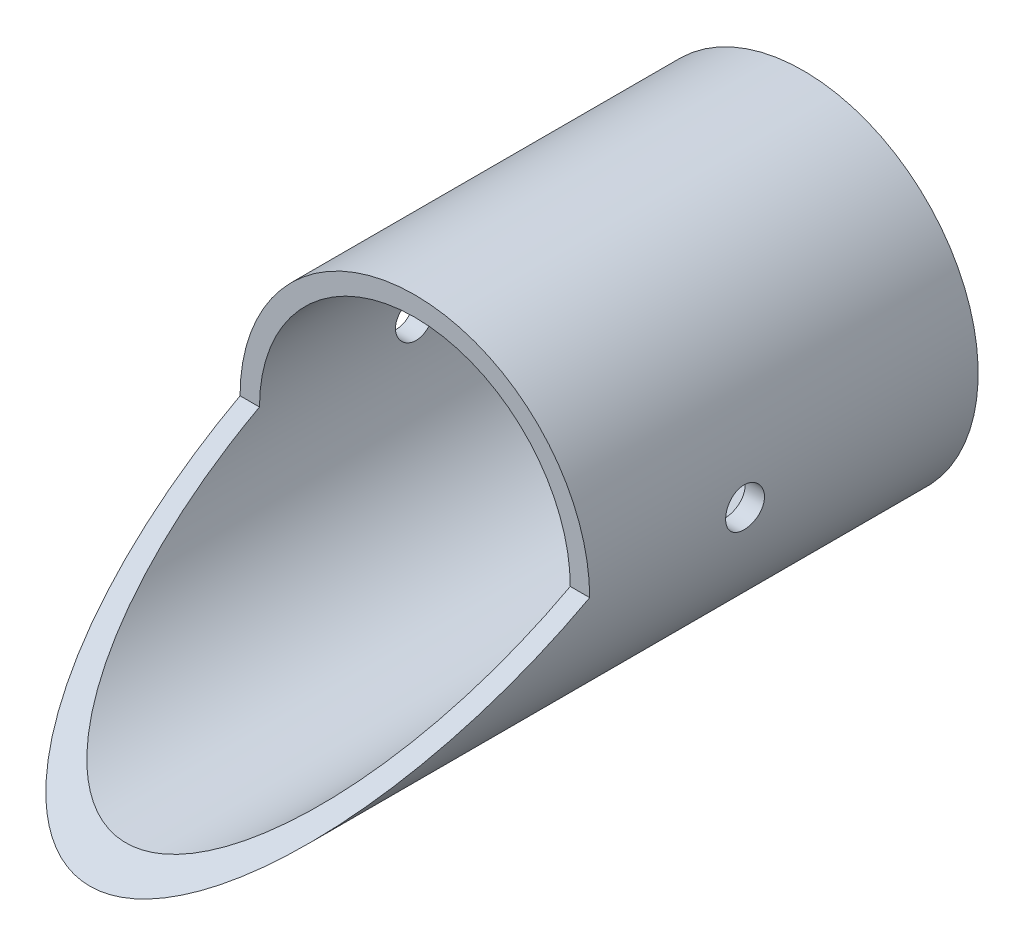
ISO-10303-21;
HEADER;
FILE_DESCRIPTION(('STEP AP214'),'2;1');
FILE_NAME('part.step','',(''),(''),'','','');
FILE_SCHEMA(('AUTOMOTIVE_DESIGN { 1 0 10303 214 1 1 1 1 }'));
ENDSEC;
DATA;
#1=APPLICATION_CONTEXT('core data for automotive mechanical design processes');
#2=APPLICATION_PROTOCOL_DEFINITION('international standard','automotive_design',2000,#1);
#3=PRODUCT_CONTEXT('',#1,'mechanical');
#4=PRODUCT('Part','Part','',(#3));
#5=PRODUCT_RELATED_PRODUCT_CATEGORY('part','',(#4));
#6=PRODUCT_DEFINITION_FORMATION('','',#4);
#7=PRODUCT_DEFINITION_CONTEXT('part definition',#1,'design');
#8=PRODUCT_DEFINITION('design','',#6,#7);
#9=PRODUCT_DEFINITION_SHAPE('','',#8);
#10=(LENGTH_UNIT() NAMED_UNIT(*) SI_UNIT(.MILLI.,.METRE.));
#11=(NAMED_UNIT(*) PLANE_ANGLE_UNIT() SI_UNIT($,.RADIAN.));
#12=(NAMED_UNIT(*) SI_UNIT($,.STERADIAN.) SOLID_ANGLE_UNIT());
#13=UNCERTAINTY_MEASURE_WITH_UNIT(LENGTH_MEASURE(1.E-05),#10,'distance_accuracy_value','');
#14=(GEOMETRIC_REPRESENTATION_CONTEXT(3) GLOBAL_UNCERTAINTY_ASSIGNED_CONTEXT((#13)) GLOBAL_UNIT_ASSIGNED_CONTEXT((#10,
#11,#12)) REPRESENTATION_CONTEXT('',''));
#15=CARTESIAN_POINT('',(0.,0.,0.));
#16=DIRECTION('',(0.,0.,1.));
#17=DIRECTION('',(1.,0.,0.));
#18=AXIS2_PLACEMENT_3D('',#15,#16,#17);
#19=CARTESIAN_POINT('',(0.,0.,-127.));
#20=DIRECTION('',(0.,0.,1.));
#21=DIRECTION('',(1.,0.,0.));
#22=AXIS2_PLACEMENT_3D('',#19,#20,#21);
#23=CYLINDRICAL_SURFACE('',#22,57.15);
#24=CARTESIAN_POINT('',(57.15,0.,-163.405823369828));
#25=CARTESIAN_POINT('',(57.1500005609097,0.177816048876493,-163.405825237907));
#26=CARTESIAN_POINT('',(57.1491684581636,0.355604047240149,-163.398351666346));
#27=CARTESIAN_POINT('',(57.145864492948,0.709967487772472,-163.368513653026));
#28=CARTESIAN_POINT('',(57.1433922462043,0.886542635981262,-163.346145721621));
#29=CARTESIAN_POINT('',(57.13687422781,1.23729697523454,-163.286655331096));
#30=CARTESIAN_POINT('',(57.1328272362062,1.41147420002936,-163.249521432307));
#31=CARTESIAN_POINT('',(57.1232725223232,1.75612236097421,-163.160756614531));
#32=CARTESIAN_POINT('',(57.1177642653076,1.92659191557827,-163.109120388146));
#33=CARTESIAN_POINT('',(57.1054492402291,2.26238128669414,-162.991792531773));
#34=CARTESIAN_POINT('',(57.0986437839985,2.42770611115798,-162.926115093297));
#35=CARTESIAN_POINT('',(57.0839192550528,2.75228402779999,-162.781121418533));
#36=CARTESIAN_POINT('',(57.0759997724479,2.91153485760114,-162.701800159794));
#37=CARTESIAN_POINT('',(57.0592759975992,3.22269899051497,-162.530151211766));
#38=CARTESIAN_POINT('',(57.0504722052186,3.37461636781084,-162.437830858593));
#39=CARTESIAN_POINT('',(57.0322190937194,3.67020768950233,-162.240766908012));
#40=CARTESIAN_POINT('',(57.0227695364524,3.81387855637789,-162.136018716807));
#41=CARTESIAN_POINT('',(57.0034579680289,4.09241269625947,-161.914468952514));
#42=CARTESIAN_POINT('',(56.9935946119046,4.22724289612082,-161.797625915103));
#43=CARTESIAN_POINT('',(56.9737613284258,4.4866414259,-161.55297206519));
#44=CARTESIAN_POINT('',(56.9637913630181,4.61120594337352,-161.425157213659));
#45=CARTESIAN_POINT('',(56.9440331491739,4.84910668497169,-161.159534136842));
#46=CARTESIAN_POINT('',(56.9342448436354,4.96244648771837,-161.021729121009));
#47=CARTESIAN_POINT('',(56.915119986707,5.17718505069055,-160.737000217259));
#48=CARTESIAN_POINT('',(56.9057836033318,5.27857938964015,-160.590072983542));
#49=CARTESIAN_POINT('',(56.8878111460117,5.4688758483936,-160.287828707105));
#50=CARTESIAN_POINT('',(56.8791767139612,5.55774901718543,-160.132493334175));
#51=CARTESIAN_POINT('',(56.8628759896914,5.7221200762037,-159.814781327527));
#52=CARTESIAN_POINT('',(56.8552100575431,5.79761299606994,-159.652402104996));
#53=CARTESIAN_POINT('',(56.8410739120636,5.93460809172924,-159.321855904961));
#54=CARTESIAN_POINT('',(56.8346032293785,5.99611576149038,-159.153691230209));
#55=CARTESIAN_POINT('',(56.8230369054203,6.10474532188343,-158.81271374864));
#56=CARTESIAN_POINT('',(56.8179417699667,6.15186192143035,-158.639899257598));
#57=CARTESIAN_POINT('',(56.8050000380462,6.27065904090687,-158.117897143006));
#58=CARTESIAN_POINT('',(56.7994199806774,6.32050936990799,-157.763402016069));
#59=CARTESIAN_POINT('',(56.7950085271993,6.36001949261459,-157.051229613156));
#60=CARTESIAN_POINT('',(56.796176914606,6.34968121711588,-156.693552439624));
#61=CARTESIAN_POINT('',(56.8050955139542,6.26938780031694,-155.986626396527));
#62=CARTESIAN_POINT('',(56.8128161476685,6.1997005678187,-155.637346892879));
#63=CARTESIAN_POINT('',(56.8339262464922,6.00308367945083,-154.955485186162));
#64=CARTESIAN_POINT('',(56.8473158042613,5.87615308792527,-154.622903256116));
#65=CARTESIAN_POINT('',(56.8782881313644,5.56836564687072,-153.983019960701));
#66=CARTESIAN_POINT('',(56.8958800491986,5.38739092571746,-153.675775746203));
#67=CARTESIAN_POINT('',(56.9332677308336,4.97673546134456,-153.095919751522));
#68=CARTESIAN_POINT('',(56.9530635743076,4.74705295703452,-152.823309224133));
#69=CARTESIAN_POINT('',(56.992760318814,4.24401024782595,-152.318901294524));
#70=CARTESIAN_POINT('',(57.0126612043425,3.97041879128192,-152.087334453295));
#71=CARTESIAN_POINT('',(57.0502242619858,3.38812448509091,-151.673377987962));
#72=CARTESIAN_POINT('',(57.0678864306088,3.07942158068166,-151.49098844056));
#73=CARTESIAN_POINT('',(57.0989898478395,2.43550006602268,-151.180569172048));
#74=CARTESIAN_POINT('',(57.1124300992449,2.10027521475246,-151.052552291064));
#75=CARTESIAN_POINT('',(57.1335657078472,1.41290597464786,-150.854687132738));
#76=CARTESIAN_POINT('',(57.1412612772961,1.06076221143806,-150.784836706276));
#77=CARTESIAN_POINT('',(57.1500130513396,0.35154657859596,-150.705582381854));
#78=CARTESIAN_POINT('',(57.1511041760923,-0.00548934941241151,-150.695860555626));
#79=CARTESIAN_POINT('',(57.1466180282725,-0.716105338897948,-150.736302712455));
#80=CARTESIAN_POINT('',(57.1410408673515,-1.06968545813806,-150.786465692821));
#81=CARTESIAN_POINT('',(57.1238668710918,-1.76242681423452,-150.944989575215));
#82=CARTESIAN_POINT('',(57.1122855538341,-2.10162279450981,-151.053200474033));
#83=CARTESIAN_POINT('',(57.0844013364178,-2.75705020557687,-151.324593672433));
#84=CARTESIAN_POINT('',(57.0680983072234,-3.07328100847677,-151.487777474346));
#85=CARTESIAN_POINT('',(57.0325045826819,-3.67523162451853,-151.865264365942));
#86=CARTESIAN_POINT('',(57.0132018722615,-3.96082056621969,-152.079774994017));
#87=CARTESIAN_POINT('',(56.9738102363796,-4.49205294644288,-152.553531733843));
#88=CARTESIAN_POINT('',(56.9537212864592,-4.73769514104684,-152.812779238155));
#89=CARTESIAN_POINT('',(56.9149149818071,-5.18317562117353,-153.370038718555));
#90=CARTESIAN_POINT('',(56.8962041559337,-5.38280436546451,-153.668218708007));
#91=CARTESIAN_POINT('',(56.8623760009416,-5.72914599578015,-154.294073661438));
#92=CARTESIAN_POINT('',(56.847258612889,-5.87585974965338,-154.621748141572));
#93=CARTESIAN_POINT('',(56.8223696882196,-6.11186737653867,-155.29652303693));
#94=CARTESIAN_POINT('',(56.8125868064234,-6.2012831797148,-155.643580481428));
#95=CARTESIAN_POINT('',(56.7994472548155,-6.32052646211081,-156.348093780007));
#96=CARTESIAN_POINT('',(56.7960903532984,-6.35035608986669,-156.705549258688));
#97=CARTESIAN_POINT('',(56.7961452921592,-6.34981731919166,-157.24034305497));
#98=CARTESIAN_POINT('',(56.7970045174463,-6.34215701251517,-157.417985277052));
#99=CARTESIAN_POINT('',(56.8003667092619,-6.3119826400425,-157.771970182747));
#100=CARTESIAN_POINT('',(56.8028690647539,-6.28947409589637,-157.948313324813));
#101=CARTESIAN_POINT('',(56.809449807706,-6.22975114423565,-158.298514766396));
#102=CARTESIAN_POINT('',(56.8135287709552,-6.19253136395294,-158.472372134005));
#103=CARTESIAN_POINT('',(56.823143225672,-6.10367852096953,-158.816257840445));
#104=CARTESIAN_POINT('',(56.8286781856725,-6.05205071705814,-158.986287551909));
#105=CARTESIAN_POINT('',(56.841048640461,-5.93474215139071,-159.321404555716));
#106=CARTESIAN_POINT('',(56.8478843172011,-5.86905942338476,-159.486491152842));
#107=CARTESIAN_POINT('',(56.8626587900486,-5.72414489037504,-159.810482359911));
#108=CARTESIAN_POINT('',(56.8705971840103,-5.64491802231296,-159.969389196609));
#109=CARTESIAN_POINT('',(56.8873576721608,-5.47343199605317,-160.28003343284));
#110=CARTESIAN_POINT('',(56.8961800831701,-5.38116816067683,-160.431768233125));
#111=CARTESIAN_POINT('',(56.9144544174229,-5.18431690056117,-160.726900957511));
#112=CARTESIAN_POINT('',(56.9239061122923,-5.07973393608525,-160.870301871067));
#113=CARTESIAN_POINT('',(56.9432311438067,-4.85832691293355,-161.148616683459));
#114=CARTESIAN_POINT('',(56.9531065546193,-4.74143725487904,-161.283478257802));
#115=CARTESIAN_POINT('',(56.9729460074962,-4.49677402335917,-161.542837286957));
#116=CARTESIAN_POINT('',(56.9829100159967,-4.36900442639673,-161.667338495756));
#117=CARTESIAN_POINT('',(57.0026552270581,-4.10335747743369,-161.905232288721));
#118=CARTESIAN_POINT('',(57.0124363151128,-3.96547404364705,-162.018618091481));
#119=CARTESIAN_POINT('',(57.0315299842632,-3.68068516957798,-162.233356517142));
#120=CARTESIAN_POINT('',(57.0408427370563,-3.53378308016079,-162.334713568737));
#121=CARTESIAN_POINT('',(57.058771683225,-3.23142123122413,-162.525049796246));
#122=CARTESIAN_POINT('',(57.0673853843867,-3.07593391221797,-162.613985436175));
#123=CARTESIAN_POINT('',(57.0836328110596,-2.75802228820545,-162.778395102966));
#124=CARTESIAN_POINT('',(57.091266895437,-2.59560055273293,-162.853874063427));
#125=CARTESIAN_POINT('',(57.1053359354229,-2.26504776825249,-162.990807148503));
#126=CARTESIAN_POINT('',(57.1117718529729,-2.09692142849408,-163.052272532825));
#127=CARTESIAN_POINT('',(57.1232677572408,-1.75609365667077,-163.160790435943));
#128=CARTESIAN_POINT('',(57.1283280763064,-1.58339334077393,-163.207846436426));
#129=CARTESIAN_POINT('',(57.1383207583435,-1.1781474049039,-163.300058733342));
#130=CARTESIAN_POINT('',(57.1426827086499,-0.944306844017976,-163.339681235092));
#131=CARTESIAN_POINT('',(57.1485219482363,-0.473627597370484,-163.392562238472));
#132=CARTESIAN_POINT('',(57.149999253064,-0.236788927774996,-163.405820882198));
#133=CARTESIAN_POINT('',(57.15,0.,-163.405823369828));
#134=B_SPLINE_CURVE_WITH_KNOTS('',3,(#24,#25,#26,#27,#28,#29,#30,#31,#32,#33,#34,#35,#36,#37,
#38,#39,#40,#41,#42,#43,#44,#45,#46,#47,#48,#49,#50,#51,#52,#53,#54,#55,#56,#57,#58,#59,#60,#61,
#62,#63,#64,#65,#66,#67,#68,#69,#70,#71,#72,#73,#74,#75,#76,#77,#78,#79,#80,#81,#82,#83,#84,#85,
#86,#87,#88,#89,#90,#91,#92,#93,#94,#95,#96,#97,#98,#99,#100,#101,#102,#103,#104,#105,#106,#107,
#108,#109,#110,#111,#112,#113,#114,#115,#116,#117,#118,#119,#120,#121,#122,#123,#124,#125,#126,
#127,#128,#129,#130,#131,#132,#133),.UNSPECIFIED.,.T.,.F.,(4,2,2,2,2,2,2,2,2,2,2,2,2,2,2,2,2,2,
2,2,2,2,2,2,2,2,2,2,2,2,2,2,2,2,2,2,2,2,2,2,2,2,2,2,2,2,2,2,2,2,2,2,2,2,4),(0.,0.53324101923671,
1.06660701717908,1.60038703849729,2.13436266169738,2.66780112354703,3.20143637225644,
3.73477165894474,4.26830470429128,4.80373155168273,5.33935635685182,5.87480984262637,
6.41046089287,6.94733081532389,7.48439975272599,8.02125734194454,8.5583120776753,
9.62681253671113,10.6952787194109,11.7589471193628,12.8226329058507,13.8886557755414,
14.9547171951862,16.0265894346503,17.0984633459042,18.1705902400271,19.2426775196957,
20.3090912880037,21.3754872008932,22.4391405930794,23.5028230557173,24.570881412401,
25.6389730214236,26.7118365434302,27.7846824688085,28.8552377269736,29.9257543827612,
30.4586639644411,30.9913754833747,31.5242817367269,32.0569937382641,32.5897803137029,
33.122373096874,33.6551574419532,34.1877494766639,34.723339858867,35.2587353218002,
35.7944554177155,36.3299776584983,36.8673321284694,37.4044891822509,37.9412131050309,
38.4778072386475,39.1879020278306,39.897992989746),.UNSPECIFIED.);
#135=CARTESIAN_POINT('',(57.15,0.,-163.405823369828));
#136=VERTEX_POINT('',#135);
#137=EDGE_CURVE('E95',#136,#136,#134,.T.);
#138=ORIENTED_EDGE('',*,*,#137,.F.);
#139=EDGE_LOOP('',(#138));
#140=FACE_BOUND('',#139,.T.);
#141=CARTESIAN_POINT('',(-57.15,0.,-163.405823369828));
#142=CARTESIAN_POINT('',(-57.1500005609097,-0.177816048876493,-163.405825237907));
#143=CARTESIAN_POINT('',(-57.1491684581636,-0.355604047240149,-163.398351666346));
#144=CARTESIAN_POINT('',(-57.145864492948,-0.709967487772472,-163.368513653026));
#145=CARTESIAN_POINT('',(-57.1433922462043,-0.886542635981262,-163.346145721621));
#146=CARTESIAN_POINT('',(-57.13687422781,-1.23729697523454,-163.286655331096));
#147=CARTESIAN_POINT('',(-57.1328272362062,-1.41147420002936,-163.249521432307));
#148=CARTESIAN_POINT('',(-57.1232725223232,-1.75612236097421,-163.160756614531));
#149=CARTESIAN_POINT('',(-57.1177642653076,-1.92659191557827,-163.109120388146));
#150=CARTESIAN_POINT('',(-57.1054492402291,-2.26238128669414,-162.991792531773));
#151=CARTESIAN_POINT('',(-57.0986437839985,-2.42770611115798,-162.926115093297));
#152=CARTESIAN_POINT('',(-57.0839192550528,-2.75228402779999,-162.781121418533));
#153=CARTESIAN_POINT('',(-57.0759997724479,-2.91153485760114,-162.701800159794));
#154=CARTESIAN_POINT('',(-57.0592759975992,-3.22269899051497,-162.530151211766));
#155=CARTESIAN_POINT('',(-57.0504722052186,-3.37461636781084,-162.437830858593));
#156=CARTESIAN_POINT('',(-57.0322190937194,-3.67020768950233,-162.240766908012));
#157=CARTESIAN_POINT('',(-57.0227695364524,-3.81387855637789,-162.136018716807));
#158=CARTESIAN_POINT('',(-57.0034579680289,-4.09241269625947,-161.914468952514));
#159=CARTESIAN_POINT('',(-56.9935946119046,-4.22724289612082,-161.797625915103));
#160=CARTESIAN_POINT('',(-56.9737613284258,-4.4866414259,-161.55297206519));
#161=CARTESIAN_POINT('',(-56.9637913630181,-4.61120594337352,-161.425157213659));
#162=CARTESIAN_POINT('',(-56.9440331491739,-4.84910668497169,-161.159534136842));
#163=CARTESIAN_POINT('',(-56.9342448436354,-4.96244648771837,-161.021729121009));
#164=CARTESIAN_POINT('',(-56.915119986707,-5.17718505069055,-160.737000217259));
#165=CARTESIAN_POINT('',(-56.9057836033318,-5.27857938964015,-160.590072983542));
#166=CARTESIAN_POINT('',(-56.8878111460117,-5.4688758483936,-160.287828707105));
#167=CARTESIAN_POINT('',(-56.8791767139612,-5.55774901718543,-160.132493334175));
#168=CARTESIAN_POINT('',(-56.8628759896914,-5.7221200762037,-159.814781327527));
#169=CARTESIAN_POINT('',(-56.8552100575431,-5.79761299606994,-159.652402104996));
#170=CARTESIAN_POINT('',(-56.8410739120636,-5.93460809172924,-159.321855904961));
#171=CARTESIAN_POINT('',(-56.8346032293785,-5.99611576149038,-159.153691230209));
#172=CARTESIAN_POINT('',(-56.8230369054203,-6.10474532188343,-158.81271374864));
#173=CARTESIAN_POINT('',(-56.8179417699667,-6.15186192143035,-158.639899257598));
#174=CARTESIAN_POINT('',(-56.8050000380462,-6.27065904090687,-158.117897143006));
#175=CARTESIAN_POINT('',(-56.7994199806774,-6.32050936990799,-157.763402016069));
#176=CARTESIAN_POINT('',(-56.7950085271993,-6.36001949261459,-157.051229613156));
#177=CARTESIAN_POINT('',(-56.796176914606,-6.34968121711588,-156.693552439624));
#178=CARTESIAN_POINT('',(-56.8050955139542,-6.26938780031694,-155.986626396527));
#179=CARTESIAN_POINT('',(-56.8128161476685,-6.1997005678187,-155.637346892879));
#180=CARTESIAN_POINT('',(-56.8339262464922,-6.00308367945083,-154.955485186162));
#181=CARTESIAN_POINT('',(-56.8473158042613,-5.87615308792527,-154.622903256116));
#182=CARTESIAN_POINT('',(-56.8782881313644,-5.56836564687072,-153.983019960701));
#183=CARTESIAN_POINT('',(-56.8958800491986,-5.38739092571746,-153.675775746203));
#184=CARTESIAN_POINT('',(-56.9332677308336,-4.97673546134456,-153.095919751522));
#185=CARTESIAN_POINT('',(-56.9530635743076,-4.74705295703452,-152.823309224133));
#186=CARTESIAN_POINT('',(-56.992760318814,-4.24401024782595,-152.318901294524));
#187=CARTESIAN_POINT('',(-57.0126612043425,-3.97041879128192,-152.087334453295));
#188=CARTESIAN_POINT('',(-57.0502242619858,-3.38812448509091,-151.673377987962));
#189=CARTESIAN_POINT('',(-57.0678864306088,-3.07942158068166,-151.49098844056));
#190=CARTESIAN_POINT('',(-57.0989898478395,-2.43550006602268,-151.180569172048));
#191=CARTESIAN_POINT('',(-57.1124300992449,-2.10027521475246,-151.052552291064));
#192=CARTESIAN_POINT('',(-57.1335657078472,-1.41290597464786,-150.854687132738));
#193=CARTESIAN_POINT('',(-57.1412612772961,-1.06076221143806,-150.784836706276));
#194=CARTESIAN_POINT('',(-57.1500130513396,-0.35154657859596,-150.705582381854));
#195=CARTESIAN_POINT('',(-57.1511041760923,0.00548934941241151,-150.695860555626));
#196=CARTESIAN_POINT('',(-57.1466180282725,0.716105338897948,-150.736302712455));
#197=CARTESIAN_POINT('',(-57.1410408673515,1.06968545813806,-150.786465692821));
#198=CARTESIAN_POINT('',(-57.1238668710918,1.76242681423452,-150.944989575215));
#199=CARTESIAN_POINT('',(-57.1122855538341,2.10162279450981,-151.053200474033));
#200=CARTESIAN_POINT('',(-57.0844013364178,2.75705020557687,-151.324593672433));
#201=CARTESIAN_POINT('',(-57.0680983072234,3.07328100847677,-151.487777474346));
#202=CARTESIAN_POINT('',(-57.0325045826819,3.67523162451853,-151.865264365942));
#203=CARTESIAN_POINT('',(-57.0132018722615,3.96082056621969,-152.079774994017));
#204=CARTESIAN_POINT('',(-56.9738102363796,4.49205294644288,-152.553531733843));
#205=CARTESIAN_POINT('',(-56.9537212864592,4.73769514104684,-152.812779238155));
#206=CARTESIAN_POINT('',(-56.9149149818071,5.18317562117353,-153.370038718555));
#207=CARTESIAN_POINT('',(-56.8962041559337,5.38280436546451,-153.668218708007));
#208=CARTESIAN_POINT('',(-56.8623760009416,5.72914599578015,-154.294073661438));
#209=CARTESIAN_POINT('',(-56.847258612889,5.87585974965338,-154.621748141572));
#210=CARTESIAN_POINT('',(-56.8223696882196,6.11186737653867,-155.29652303693));
#211=CARTESIAN_POINT('',(-56.8125868064234,6.2012831797148,-155.643580481428));
#212=CARTESIAN_POINT('',(-56.7994472548155,6.32052646211081,-156.348093780007));
#213=CARTESIAN_POINT('',(-56.7960903532984,6.35035608986669,-156.705549258688));
#214=CARTESIAN_POINT('',(-56.7961452921592,6.34981731919166,-157.24034305497));
#215=CARTESIAN_POINT('',(-56.7970045174463,6.34215701251517,-157.417985277052));
#216=CARTESIAN_POINT('',(-56.8003667092619,6.3119826400425,-157.771970182747));
#217=CARTESIAN_POINT('',(-56.8028690647539,6.28947409589637,-157.948313324813));
#218=CARTESIAN_POINT('',(-56.809449807706,6.22975114423565,-158.298514766396));
#219=CARTESIAN_POINT('',(-56.8135287709552,6.19253136395294,-158.472372134005));
#220=CARTESIAN_POINT('',(-56.823143225672,6.10367852096953,-158.816257840445));
#221=CARTESIAN_POINT('',(-56.8286781856725,6.05205071705814,-158.986287551909));
#222=CARTESIAN_POINT('',(-56.841048640461,5.93474215139071,-159.321404555716));
#223=CARTESIAN_POINT('',(-56.8478843172011,5.86905942338476,-159.486491152842));
#224=CARTESIAN_POINT('',(-56.8626587900486,5.72414489037504,-159.810482359911));
#225=CARTESIAN_POINT('',(-56.8705971840103,5.64491802231296,-159.969389196609));
#226=CARTESIAN_POINT('',(-56.8873576721608,5.47343199605317,-160.28003343284));
#227=CARTESIAN_POINT('',(-56.8961800831701,5.38116816067683,-160.431768233125));
#228=CARTESIAN_POINT('',(-56.9144544174229,5.18431690056117,-160.726900957511));
#229=CARTESIAN_POINT('',(-56.9239061122923,5.07973393608525,-160.870301871067));
#230=CARTESIAN_POINT('',(-56.9432311438067,4.85832691293355,-161.148616683459));
#231=CARTESIAN_POINT('',(-56.9531065546193,4.74143725487904,-161.283478257802));
#232=CARTESIAN_POINT('',(-56.9729460074962,4.49677402335917,-161.542837286957));
#233=CARTESIAN_POINT('',(-56.9829100159967,4.36900442639673,-161.667338495756));
#234=CARTESIAN_POINT('',(-57.0026552270581,4.10335747743369,-161.905232288721));
#235=CARTESIAN_POINT('',(-57.0124363151128,3.96547404364705,-162.018618091481));
#236=CARTESIAN_POINT('',(-57.0315299842632,3.68068516957798,-162.233356517142));
#237=CARTESIAN_POINT('',(-57.0408427370563,3.53378308016079,-162.334713568737));
#238=CARTESIAN_POINT('',(-57.058771683225,3.23142123122413,-162.525049796246));
#239=CARTESIAN_POINT('',(-57.0673853843867,3.07593391221797,-162.613985436175));
#240=CARTESIAN_POINT('',(-57.0836328110596,2.75802228820545,-162.778395102966));
#241=CARTESIAN_POINT('',(-57.091266895437,2.59560055273293,-162.853874063427));
#242=CARTESIAN_POINT('',(-57.1053359354229,2.26504776825249,-162.990807148503));
#243=CARTESIAN_POINT('',(-57.1117718529729,2.09692142849408,-163.052272532825));
#244=CARTESIAN_POINT('',(-57.1232677572408,1.75609365667077,-163.160790435943));
#245=CARTESIAN_POINT('',(-57.1283280763064,1.58339334077393,-163.207846436426));
#246=CARTESIAN_POINT('',(-57.1383207583435,1.1781474049039,-163.300058733342));
#247=CARTESIAN_POINT('',(-57.1426827086499,0.944306844017976,-163.339681235092));
#248=CARTESIAN_POINT('',(-57.1485219482363,0.473627597370484,-163.392562238472));
#249=CARTESIAN_POINT('',(-57.149999253064,0.236788927774996,-163.405820882198));
#250=CARTESIAN_POINT('',(-57.15,0.,-163.405823369828));
#251=B_SPLINE_CURVE_WITH_KNOTS('',3,(#141,#142,#143,#144,#145,#146,#147,#148,#149,#150,#151,
#152,#153,#154,#155,#156,#157,#158,#159,#160,#161,#162,#163,#164,#165,#166,#167,#168,#169,#170,
#171,#172,#173,#174,#175,#176,#177,#178,#179,#180,#181,#182,#183,#184,#185,#186,#187,#188,#189,
#190,#191,#192,#193,#194,#195,#196,#197,#198,#199,#200,#201,#202,#203,#204,#205,#206,#207,#208,
#209,#210,#211,#212,#213,#214,#215,#216,#217,#218,#219,#220,#221,#222,#223,#224,#225,#226,#227,
#228,#229,#230,#231,#232,#233,#234,#235,#236,#237,#238,#239,#240,#241,#242,#243,#244,#245,#246,
#247,#248,#249,#250),.UNSPECIFIED.,.T.,.F.,(4,2,2,2,2,2,2,2,2,2,2,2,2,2,2,2,2,2,2,2,2,2,2,2,2,2,
2,2,2,2,2,2,2,2,2,2,2,2,2,2,2,2,2,2,2,2,2,2,2,2,2,2,2,2,4),(0.,0.53324101923671,
1.06660701717908,1.60038703849729,2.13436266169738,2.66780112354703,3.20143637225644,
3.73477165894474,4.26830470429128,4.80373155168273,5.33935635685182,5.87480984262637,
6.41046089287,6.94733081532389,7.48439975272599,8.02125734194454,8.5583120776753,
9.62681253671113,10.6952787194109,11.7589471193628,12.8226329058507,13.8886557755414,
14.9547171951862,16.0265894346503,17.0984633459042,18.1705902400271,19.2426775196957,
20.3090912880037,21.3754872008932,22.4391405930794,23.5028230557173,24.570881412401,
25.6389730214236,26.7118365434302,27.7846824688085,28.8552377269736,29.9257543827612,
30.4586639644411,30.9913754833747,31.5242817367269,32.0569937382641,32.5897803137029,
33.122373096874,33.6551574419532,34.1877494766639,34.723339858867,35.2587353218002,
35.7944554177155,36.3299776584983,36.8673321284694,37.4044891822509,37.9412131050309,
38.4778072386475,39.1879020278306,39.897992989746),.UNSPECIFIED.);
#252=CARTESIAN_POINT('',(-57.15,0.,-163.405823369828));
#253=VERTEX_POINT('',#252);
#254=EDGE_CURVE('E104',#253,#253,#251,.T.);
#255=ORIENTED_EDGE('',*,*,#254,.F.);
#256=EDGE_LOOP('',(#255));
#257=FACE_BOUND('',#256,.T.);
#258=CARTESIAN_POINT('',(0.,0.,-106.255823369828));
#259=DIRECTION('',(0.,-0.880694764772711,-0.473684210526316));
#260=DIRECTION('',(0.,-0.473684210526316,0.880694764772711));
#261=AXIS2_PLACEMENT_3D('',#258,#259,#260);
#262=ELLIPSE('',#261,120.65,57.15);
#263=CARTESIAN_POINT('',(-57.15,0.,-106.255823369828));
#264=VERTEX_POINT('',#263);
#265=CARTESIAN_POINT('',(57.15,0.,-106.255823369828));
#266=VERTEX_POINT('',#265);
#267=EDGE_CURVE('E45',#264,#266,#262,.F.);
#268=ORIENTED_EDGE('',*,*,#267,.F.);
#269=CARTESIAN_POINT('',(0.,0.,-106.255823369828));
#270=DIRECTION('',(0.,0.,-1.));
#271=DIRECTION('',(-1.,0.,0.));
#272=AXIS2_PLACEMENT_3D('',#269,#270,#271);
#273=CIRCLE('',#272,57.15);
#274=EDGE_CURVE('E63',#264,#266,#273,.T.);
#275=ORIENTED_EDGE('',*,*,#274,.T.);
#276=EDGE_LOOP('',(#268,#275));
#277=FACE_BOUND('',#276,.T.);
#278=CARTESIAN_POINT('',(0.,0.,-233.255823369828));
#279=DIRECTION('',(0.,0.,-1.));
#280=DIRECTION('',(-1.,0.,0.));
#281=AXIS2_PLACEMENT_3D('',#278,#279,#280);
#282=CIRCLE('',#281,57.15);
#283=CARTESIAN_POINT('',(-57.15,0.,-233.255823369828));
#284=VERTEX_POINT('',#283);
#285=EDGE_CURVE('E69',#284,#284,#282,.T.);
#286=ORIENTED_EDGE('',*,*,#285,.F.);
#287=EDGE_LOOP('',(#286));
#288=FACE_BOUND('',#287,.T.);
#289=ADVANCED_FACE('F33',(#140,#257,#277,#288),#23,.T.);
#290=CARTESIAN_POINT('',(0.,0.,-127.));
#291=DIRECTION('',(0.,0.,1.));
#292=DIRECTION('',(1.,0.,0.));
#293=AXIS2_PLACEMENT_3D('',#290,#291,#292);
#294=CYLINDRICAL_SURFACE('',#293,50.8);
#295=CARTESIAN_POINT('',(50.8,0.,-163.405823369828));
#296=CARTESIAN_POINT('',(50.8000006834679,0.177660452279512,-163.405825408741));
#297=CARTESIAN_POINT('',(50.7990661797892,0.355290973510378,-163.398364825604));
#298=CARTESIAN_POINT('',(50.7953557357901,0.709338366021,-163.36857979145));
#299=CARTESIAN_POINT('',(50.7925793780872,0.885754953053622,-163.346251971365));
#300=CARTESIAN_POINT('',(50.7852595825664,1.23618570300819,-163.286871034154));
#301=CARTESIAN_POINT('',(50.780714828987,1.4101979769568,-163.249806952175));
#302=CARTESIAN_POINT('',(50.7699847171763,1.75451712697435,-163.161212873706));
#303=CARTESIAN_POINT('',(50.7637987580652,1.92482262115234,-163.109677578595));
#304=CARTESIAN_POINT('',(50.7499683338145,2.26028082300217,-162.992586709574));
#305=CARTESIAN_POINT('',(50.7423254033505,2.42543874168481,-162.927045879442));
#306=CARTESIAN_POINT('',(50.7257879361097,2.74969172401869,-162.782360327768));
#307=CARTESIAN_POINT('',(50.7168929385794,2.90878452822901,-162.703210595841));
#308=CARTESIAN_POINT('',(50.6981073841004,3.21964998300995,-162.531937860928));
#309=CARTESIAN_POINT('',(50.6882173751538,3.37142659557351,-162.439821988));
#310=CARTESIAN_POINT('',(50.667709710111,3.66675816285128,-162.243199085713));
#311=CARTESIAN_POINT('',(50.6570917852451,3.81031004442855,-162.138687468939));
#312=CARTESIAN_POINT('',(50.6353782078992,4.08877364468727,-161.917529523962));
#313=CARTESIAN_POINT('',(50.6242806024837,4.22364310242768,-161.800830173104));
#314=CARTESIAN_POINT('',(50.601961144221,4.48313482314155,-161.556465173291));
#315=CARTESIAN_POINT('',(50.5907392469407,4.60775327790533,-161.428795484586));
#316=CARTESIAN_POINT('',(50.5684951642058,4.84578010749615,-161.163458929903));
#317=CARTESIAN_POINT('',(50.557472916611,4.95919202103945,-161.025795243727));
#318=CARTESIAN_POINT('',(50.5359319534137,5.17409430632028,-160.741340259713));
#319=CARTESIAN_POINT('',(50.5254134250741,5.27558026453382,-160.594545613258));
#320=CARTESIAN_POINT('',(50.505152469446,5.46614935167706,-160.292442086583));
#321=CARTESIAN_POINT('',(50.4954124708714,5.5551942696914,-160.137108932577));
#322=CARTESIAN_POINT('',(50.4770198884538,5.71990676958976,-159.819372840044));
#323=CARTESIAN_POINT('',(50.4683677094924,5.79556937487341,-159.656967299307));
#324=CARTESIAN_POINT('',(50.4524085385076,5.93289692109491,-159.32634018017));
#325=CARTESIAN_POINT('',(50.4451010101934,5.99456744482885,-159.158120952394));
#326=CARTESIAN_POINT('',(50.4320345801864,6.10351153700926,-158.817006729503));
#327=CARTESIAN_POINT('',(50.4262762473126,6.15077981821715,-158.644110042537));
#328=CARTESIAN_POINT('',(50.4116539346605,6.26991974827309,-158.12220461933));
#329=CARTESIAN_POINT('',(50.4053374088251,6.32000152949766,-157.76786663743));
#330=CARTESIAN_POINT('',(50.4003032854169,6.36001442106727,-157.055956680609));
#331=CARTESIAN_POINT('',(50.4015853822611,6.34994795030807,-156.698384836318));
#332=CARTESIAN_POINT('',(50.411557471348,6.27028296446239,-155.992073451851));
#333=CARTESIAN_POINT('',(50.4202051399018,6.20102456737441,-155.643295148532));
#334=CARTESIAN_POINT('',(50.4438714581298,6.00545126391525,-154.9623641722));
#335=CARTESIAN_POINT('',(50.4588902368859,5.8791352015231,-154.630211836192));
#336=CARTESIAN_POINT('',(50.4936536009975,5.5726721749451,-153.990887686426));
#337=CARTESIAN_POINT('',(50.5134111351251,5.39237737135386,-153.683787464354));
#338=CARTESIAN_POINT('',(50.555416054782,4.98317902548834,-153.104074088847));
#339=CARTESIAN_POINT('',(50.5776635541745,4.75427325986253,-152.831462513751));
#340=CARTESIAN_POINT('',(50.6223297954269,4.25246571612426,-152.32648895961));
#341=CARTESIAN_POINT('',(50.6447486577549,3.97927069316312,-152.094418296836));
#342=CARTESIAN_POINT('',(50.6870876657907,3.39764921629989,-151.679382794456));
#343=CARTESIAN_POINT('',(50.7070078057367,3.08922268116003,-151.496418068083));
#344=CARTESIAN_POINT('',(50.7421172666534,2.44566864345095,-151.184787821209));
#345=CARTESIAN_POINT('',(50.7573049978767,2.1105322156625,-151.056140542304));
#346=CARTESIAN_POINT('',(50.7812239587358,1.42318216919016,-150.857028314944));
#347=CARTESIAN_POINT('',(50.7899554906378,1.07096935081085,-150.78656064262));
#348=CARTESIAN_POINT('',(50.7999389488424,0.361983436172466,-150.706185512185));
#349=CARTESIAN_POINT('',(50.8012404379827,0.00525650492410468,-150.695876747823));
#350=CARTESIAN_POINT('',(50.796350985378,-0.704839932523286,-150.73505301573));
#351=CARTESIAN_POINT('',(50.7901602031923,-1.05820951006076,-150.784536774625));
#352=CARTESIAN_POINT('',(50.7710127262508,-1.75037625016445,-150.941560024554));
#353=CARTESIAN_POINT('',(50.7580783360366,-2.08921749090307,-151.048908168057));
#354=CARTESIAN_POINT('',(50.7268917673806,-2.74408812131596,-151.318414118501));
#355=CARTESIAN_POINT('',(50.7086394083772,-3.06011673597601,-151.480573786494));
#356=CARTESIAN_POINT('',(50.6687282995312,-3.66218349013088,-151.856070260998));
#357=CARTESIAN_POINT('',(50.6470524697548,-3.94805857862941,-152.069666653763));
#358=CARTESIAN_POINT('',(50.6027726239969,-4.48004432527765,-152.541607385747));
#359=CARTESIAN_POINT('',(50.580168571199,-4.72615340426592,-152.799953501194));
#360=CARTESIAN_POINT('',(50.5364268452441,-5.17304528191041,-153.355823111533));
#361=CARTESIAN_POINT('',(50.5152982525453,-5.37356206840866,-153.653561265055));
#362=CARTESIAN_POINT('',(50.4770495657174,-5.72173794062838,-154.278739416077));
#363=CARTESIAN_POINT('',(50.4599293912342,-5.86939808596192,-154.606178817993));
#364=CARTESIAN_POINT('',(50.4316957332253,-6.10724499412082,-155.280539400415));
#365=CARTESIAN_POINT('',(50.420566587835,-6.19758172467741,-155.627407141026));
#366=CARTESIAN_POINT('',(50.405537603827,-6.31867625374529,-156.331732633104));
#367=CARTESIAN_POINT('',(50.4016374288984,-6.34943682390104,-156.689189891132));
#368=CARTESIAN_POINT('',(50.4015265602809,-6.35026929057823,-157.223837893229));
#369=CARTESIAN_POINT('',(50.402435095144,-6.34308284910088,-157.401275086278));
#370=CARTESIAN_POINT('',(50.4061013328048,-6.31389085000219,-157.754889160594));
#371=CARTESIAN_POINT('',(50.4088583467614,-6.29189081269728,-157.931066486646));
#372=CARTESIAN_POINT('',(50.4161467962798,-6.23321749451058,-158.280975908565));
#373=CARTESIAN_POINT('',(50.4206788771816,-6.1965388770065,-158.454707091292));
#374=CARTESIAN_POINT('',(50.4313843766276,-6.1087988856385,-158.798382398979));
#375=CARTESIAN_POINT('',(50.4375571981034,-6.05774274337943,-158.968327877229));
#376=CARTESIAN_POINT('',(50.4513689507146,-5.9416147618522,-159.303297163047));
#377=CARTESIAN_POINT('',(50.4590078777996,-5.87654296130371,-159.46832098421));
#378=CARTESIAN_POINT('',(50.4755317786319,-5.73288012300275,-159.792237839942));
#379=CARTESIAN_POINT('',(50.4844162998358,-5.65429399287329,-159.951133074505));
#380=CARTESIAN_POINT('',(50.5031861238308,-5.48411509023544,-160.261812141848));
#381=CARTESIAN_POINT('',(50.5130717928327,-5.39251755330394,-160.413593342466));
#382=CARTESIAN_POINT('',(50.5335596413456,-5.19701859385405,-160.708882463127));
#383=CARTESIAN_POINT('',(50.5441615625256,-5.09312159732418,-160.852393331795));
#384=CARTESIAN_POINT('',(50.5658649879453,-4.87294741221253,-161.131195356753));
#385=CARTESIAN_POINT('',(50.5769694854165,-4.7565881660522,-161.266421486428));
#386=CARTESIAN_POINT('',(50.5992900846758,-4.5129587167504,-161.526555830476));
#387=CARTESIAN_POINT('',(50.6105061445442,-4.38569248450023,-161.651467767676));
#388=CARTESIAN_POINT('',(50.6327447984795,-4.12101889507185,-161.890229953595));
#389=CARTESIAN_POINT('',(50.6437672716371,-3.98360546081123,-162.004073477424));
#390=CARTESIAN_POINT('',(50.6652974325924,-3.6997147044123,-162.219773381039));
#391=CARTESIAN_POINT('',(50.6758053090419,-3.55324074911995,-162.321634173205));
#392=CARTESIAN_POINT('',(50.6960572676804,-3.25157211236692,-162.513096193313));
#393=CARTESIAN_POINT('',(50.7057979692604,-3.09634349922941,-162.602644329539));
#394=CARTESIAN_POINT('',(50.7241863205772,-2.77888304693641,-162.768296927736));
#395=CARTESIAN_POINT('',(50.7328343709848,-2.61665380433059,-162.844406321733));
#396=CARTESIAN_POINT('',(50.7487892612146,-2.28641311158368,-162.982612151045));
#397=CARTESIAN_POINT('',(50.7560971464692,-2.11840629094839,-163.044719517774));
#398=CARTESIAN_POINT('',(50.7691705327862,-1.77774856333513,-163.15452323382));
#399=CARTESIAN_POINT('',(50.7749363976312,-1.60509876229305,-163.202222982424));
#400=CARTESIAN_POINT('',(50.7864482399361,-1.1964522016478,-163.296718286772));
#401=CARTESIAN_POINT('',(50.7915088942137,-0.95904164015275,-163.337590577564));
#402=CARTESIAN_POINT('',(50.7982842992882,-0.481069086110395,-163.392141638744));
#403=CARTESIAN_POINT('',(50.799999074758,-0.240507116815048,-163.405820609657));
#404=CARTESIAN_POINT('',(50.8,0.,-163.405823369828));
#405=B_SPLINE_CURVE_WITH_KNOTS('',3,(#295,#296,#297,#298,#299,#300,#301,#302,#303,#304,#305,
#306,#307,#308,#309,#310,#311,#312,#313,#314,#315,#316,#317,#318,#319,#320,#321,#322,#323,#324,
#325,#326,#327,#328,#329,#330,#331,#332,#333,#334,#335,#336,#337,#338,#339,#340,#341,#342,#343,
#344,#345,#346,#347,#348,#349,#350,#351,#352,#353,#354,#355,#356,#357,#358,#359,#360,#361,#362,
#363,#364,#365,#366,#367,#368,#369,#370,#371,#372,#373,#374,#375,#376,#377,#378,#379,#380,#381,
#382,#383,#384,#385,#386,#387,#388,#389,#390,#391,#392,#393,#394,#395,#396,#397,#398,#399,#400,
#401,#402,#403,#404),.UNSPECIFIED.,.T.,.F.,(4,2,2,2,2,2,2,2,2,2,2,2,2,2,2,2,2,2,2,2,2,2,2,2,2,2,
2,2,2,2,2,2,2,2,2,2,2,2,2,2,2,2,2,2,2,2,2,2,2,2,2,2,2,2,4),(0.,0.532770890036461,
1.06566255254233,1.59895146960222,2.13243590507214,2.66536147825354,3.1984836802343,
3.73131385621671,4.26434184077448,4.79979383345944,5.33544385457954,5.87092418803191,
6.40660207058527,6.9438906528316,7.48137862319397,8.01865175893929,8.55612189720503,
9.6242791662587,10.6923934790566,11.7544113336051,12.8164507062087,13.8814258716387,
14.9464497570325,16.0188371886511,17.0912270930592,18.1639768555689,19.2366763909421,
20.3022119405409,21.3677247983351,22.4297356128784,23.4917824901914,24.5593058783681,
25.6268716489134,26.7005149202785,27.7741366672132,28.8449379307216,29.9156893764559,
30.4479262694048,30.9799649328867,31.512197203143,32.0442360577022,32.5762734424696,
33.1081180284451,33.640157865869,34.1720068262235,34.7076024551421,35.2430039121809,
35.7787286590514,36.3142555153479,36.8520236098181,37.3895939309911,37.9267431051648,
38.4637654468358,39.1850071972271,39.9062436290925),.UNSPECIFIED.);
#406=CARTESIAN_POINT('',(50.8,0.,-163.405823369828));
#407=VERTEX_POINT('',#406);
#408=EDGE_CURVE('E37',#407,#407,#405,.T.);
#409=ORIENTED_EDGE('',*,*,#408,.T.);
#410=EDGE_LOOP('',(#409));
#411=FACE_BOUND('',#410,.T.);
#412=CARTESIAN_POINT('',(-50.8,0.,-163.405823369828));
#413=CARTESIAN_POINT('',(-50.8000006834679,-0.177660452279512,-163.405825408741));
#414=CARTESIAN_POINT('',(-50.7990661797892,-0.355290973510378,-163.398364825604));
#415=CARTESIAN_POINT('',(-50.7953557357901,-0.709338366021,-163.36857979145));
#416=CARTESIAN_POINT('',(-50.7925793780872,-0.885754953053622,-163.346251971365));
#417=CARTESIAN_POINT('',(-50.7852595825664,-1.23618570300819,-163.286871034154));
#418=CARTESIAN_POINT('',(-50.780714828987,-1.4101979769568,-163.249806952175));
#419=CARTESIAN_POINT('',(-50.7699847171763,-1.75451712697435,-163.161212873706));
#420=CARTESIAN_POINT('',(-50.7637987580652,-1.92482262115234,-163.109677578595));
#421=CARTESIAN_POINT('',(-50.7499683338145,-2.26028082300217,-162.992586709574));
#422=CARTESIAN_POINT('',(-50.7423254033505,-2.42543874168481,-162.927045879442));
#423=CARTESIAN_POINT('',(-50.7257879361097,-2.74969172401869,-162.782360327768));
#424=CARTESIAN_POINT('',(-50.7168929385794,-2.90878452822901,-162.703210595841));
#425=CARTESIAN_POINT('',(-50.6981073841004,-3.21964998300995,-162.531937860928));
#426=CARTESIAN_POINT('',(-50.6882173751538,-3.37142659557351,-162.439821988));
#427=CARTESIAN_POINT('',(-50.667709710111,-3.66675816285128,-162.243199085713));
#428=CARTESIAN_POINT('',(-50.6570917852451,-3.81031004442855,-162.138687468939));
#429=CARTESIAN_POINT('',(-50.6353782078992,-4.08877364468727,-161.917529523962));
#430=CARTESIAN_POINT('',(-50.6242806024837,-4.22364310242768,-161.800830173104));
#431=CARTESIAN_POINT('',(-50.601961144221,-4.48313482314155,-161.556465173291));
#432=CARTESIAN_POINT('',(-50.5907392469407,-4.60775327790533,-161.428795484586));
#433=CARTESIAN_POINT('',(-50.5684951642058,-4.84578010749615,-161.163458929903));
#434=CARTESIAN_POINT('',(-50.557472916611,-4.95919202103945,-161.025795243727));
#435=CARTESIAN_POINT('',(-50.5359319534137,-5.17409430632028,-160.741340259713));
#436=CARTESIAN_POINT('',(-50.5254134250741,-5.27558026453382,-160.594545613258));
#437=CARTESIAN_POINT('',(-50.505152469446,-5.46614935167706,-160.292442086583));
#438=CARTESIAN_POINT('',(-50.4954124708714,-5.5551942696914,-160.137108932577));
#439=CARTESIAN_POINT('',(-50.4770198884538,-5.71990676958976,-159.819372840044));
#440=CARTESIAN_POINT('',(-50.4683677094924,-5.79556937487341,-159.656967299307));
#441=CARTESIAN_POINT('',(-50.4524085385076,-5.93289692109491,-159.32634018017));
#442=CARTESIAN_POINT('',(-50.4451010101934,-5.99456744482885,-159.158120952394));
#443=CARTESIAN_POINT('',(-50.4320345801864,-6.10351153700926,-158.817006729503));
#444=CARTESIAN_POINT('',(-50.4262762473126,-6.15077981821715,-158.644110042537));
#445=CARTESIAN_POINT('',(-50.4116539346605,-6.26991974827309,-158.12220461933));
#446=CARTESIAN_POINT('',(-50.4053374088251,-6.32000152949766,-157.76786663743));
#447=CARTESIAN_POINT('',(-50.4003032854169,-6.36001442106727,-157.055956680609));
#448=CARTESIAN_POINT('',(-50.4015853822611,-6.34994795030807,-156.698384836318));
#449=CARTESIAN_POINT('',(-50.411557471348,-6.27028296446239,-155.992073451851));
#450=CARTESIAN_POINT('',(-50.4202051399018,-6.20102456737441,-155.643295148532));
#451=CARTESIAN_POINT('',(-50.4438714581298,-6.00545126391525,-154.9623641722));
#452=CARTESIAN_POINT('',(-50.4588902368859,-5.8791352015231,-154.630211836192));
#453=CARTESIAN_POINT('',(-50.4936536009975,-5.5726721749451,-153.990887686426));
#454=CARTESIAN_POINT('',(-50.5134111351251,-5.39237737135386,-153.683787464354));
#455=CARTESIAN_POINT('',(-50.555416054782,-4.98317902548834,-153.104074088847));
#456=CARTESIAN_POINT('',(-50.5776635541745,-4.75427325986253,-152.831462513751));
#457=CARTESIAN_POINT('',(-50.6223297954269,-4.25246571612426,-152.32648895961));
#458=CARTESIAN_POINT('',(-50.6447486577549,-3.97927069316312,-152.094418296836));
#459=CARTESIAN_POINT('',(-50.6870876657907,-3.39764921629989,-151.679382794456));
#460=CARTESIAN_POINT('',(-50.7070078057367,-3.08922268116003,-151.496418068083));
#461=CARTESIAN_POINT('',(-50.7421172666534,-2.44566864345095,-151.184787821209));
#462=CARTESIAN_POINT('',(-50.7573049978767,-2.1105322156625,-151.056140542304));
#463=CARTESIAN_POINT('',(-50.7812239587358,-1.42318216919016,-150.857028314944));
#464=CARTESIAN_POINT('',(-50.7899554906378,-1.07096935081085,-150.78656064262));
#465=CARTESIAN_POINT('',(-50.7999389488424,-0.361983436172466,-150.706185512185));
#466=CARTESIAN_POINT('',(-50.8012404379827,-0.00525650492410468,-150.695876747823));
#467=CARTESIAN_POINT('',(-50.796350985378,0.704839932523286,-150.73505301573));
#468=CARTESIAN_POINT('',(-50.7901602031923,1.05820951006076,-150.784536774625));
#469=CARTESIAN_POINT('',(-50.7710127262508,1.75037625016445,-150.941560024554));
#470=CARTESIAN_POINT('',(-50.7580783360366,2.08921749090307,-151.048908168057));
#471=CARTESIAN_POINT('',(-50.7268917673806,2.74408812131596,-151.318414118501));
#472=CARTESIAN_POINT('',(-50.7086394083772,3.06011673597601,-151.480573786494));
#473=CARTESIAN_POINT('',(-50.6687282995312,3.66218349013088,-151.856070260998));
#474=CARTESIAN_POINT('',(-50.6470524697548,3.94805857862941,-152.069666653763));
#475=CARTESIAN_POINT('',(-50.6027726239969,4.48004432527765,-152.541607385747));
#476=CARTESIAN_POINT('',(-50.580168571199,4.72615340426592,-152.799953501194));
#477=CARTESIAN_POINT('',(-50.5364268452441,5.17304528191041,-153.355823111533));
#478=CARTESIAN_POINT('',(-50.5152982525453,5.37356206840866,-153.653561265055));
#479=CARTESIAN_POINT('',(-50.4770495657174,5.72173794062838,-154.278739416077));
#480=CARTESIAN_POINT('',(-50.4599293912342,5.86939808596192,-154.606178817993));
#481=CARTESIAN_POINT('',(-50.4316957332253,6.10724499412082,-155.280539400415));
#482=CARTESIAN_POINT('',(-50.420566587835,6.19758172467741,-155.627407141026));
#483=CARTESIAN_POINT('',(-50.405537603827,6.31867625374529,-156.331732633104));
#484=CARTESIAN_POINT('',(-50.4016374288984,6.34943682390104,-156.689189891132));
#485=CARTESIAN_POINT('',(-50.4015265602809,6.35026929057823,-157.223837893229));
#486=CARTESIAN_POINT('',(-50.402435095144,6.34308284910088,-157.401275086278));
#487=CARTESIAN_POINT('',(-50.4061013328048,6.31389085000219,-157.754889160594));
#488=CARTESIAN_POINT('',(-50.4088583467614,6.29189081269728,-157.931066486646));
#489=CARTESIAN_POINT('',(-50.4161467962798,6.23321749451058,-158.280975908565));
#490=CARTESIAN_POINT('',(-50.4206788771816,6.1965388770065,-158.454707091292));
#491=CARTESIAN_POINT('',(-50.4313843766276,6.1087988856385,-158.798382398979));
#492=CARTESIAN_POINT('',(-50.4375571981034,6.05774274337943,-158.968327877229));
#493=CARTESIAN_POINT('',(-50.4513689507146,5.9416147618522,-159.303297163047));
#494=CARTESIAN_POINT('',(-50.4590078777996,5.87654296130371,-159.46832098421));
#495=CARTESIAN_POINT('',(-50.4755317786319,5.73288012300275,-159.792237839942));
#496=CARTESIAN_POINT('',(-50.4844162998358,5.65429399287329,-159.951133074505));
#497=CARTESIAN_POINT('',(-50.5031861238308,5.48411509023544,-160.261812141848));
#498=CARTESIAN_POINT('',(-50.5130717928327,5.39251755330394,-160.413593342466));
#499=CARTESIAN_POINT('',(-50.5335596413456,5.19701859385405,-160.708882463127));
#500=CARTESIAN_POINT('',(-50.5441615625256,5.09312159732418,-160.852393331795));
#501=CARTESIAN_POINT('',(-50.5658649879453,4.87294741221253,-161.131195356753));
#502=CARTESIAN_POINT('',(-50.5769694854165,4.7565881660522,-161.266421486428));
#503=CARTESIAN_POINT('',(-50.5992900846758,4.5129587167504,-161.526555830476));
#504=CARTESIAN_POINT('',(-50.6105061445442,4.38569248450023,-161.651467767676));
#505=CARTESIAN_POINT('',(-50.6327447984795,4.12101889507185,-161.890229953595));
#506=CARTESIAN_POINT('',(-50.6437672716371,3.98360546081123,-162.004073477424));
#507=CARTESIAN_POINT('',(-50.6652974325924,3.6997147044123,-162.219773381039));
#508=CARTESIAN_POINT('',(-50.6758053090419,3.55324074911995,-162.321634173205));
#509=CARTESIAN_POINT('',(-50.6960572676804,3.25157211236692,-162.513096193313));
#510=CARTESIAN_POINT('',(-50.7057979692604,3.09634349922941,-162.602644329539));
#511=CARTESIAN_POINT('',(-50.7241863205772,2.77888304693641,-162.768296927736));
#512=CARTESIAN_POINT('',(-50.7328343709848,2.61665380433059,-162.844406321733));
#513=CARTESIAN_POINT('',(-50.7487892612146,2.28641311158368,-162.982612151045));
#514=CARTESIAN_POINT('',(-50.7560971464692,2.11840629094839,-163.044719517774));
#515=CARTESIAN_POINT('',(-50.7691705327862,1.77774856333513,-163.15452323382));
#516=CARTESIAN_POINT('',(-50.7749363976312,1.60509876229305,-163.202222982424));
#517=CARTESIAN_POINT('',(-50.7864482399361,1.1964522016478,-163.296718286772));
#518=CARTESIAN_POINT('',(-50.7915088942137,0.95904164015275,-163.337590577564));
#519=CARTESIAN_POINT('',(-50.7982842992882,0.481069086110395,-163.392141638744));
#520=CARTESIAN_POINT('',(-50.799999074758,0.240507116815048,-163.405820609657));
#521=CARTESIAN_POINT('',(-50.8,0.,-163.405823369828));
#522=B_SPLINE_CURVE_WITH_KNOTS('',3,(#412,#413,#414,#415,#416,#417,#418,#419,#420,#421,#422,
#423,#424,#425,#426,#427,#428,#429,#430,#431,#432,#433,#434,#435,#436,#437,#438,#439,#440,#441,
#442,#443,#444,#445,#446,#447,#448,#449,#450,#451,#452,#453,#454,#455,#456,#457,#458,#459,#460,
#461,#462,#463,#464,#465,#466,#467,#468,#469,#470,#471,#472,#473,#474,#475,#476,#477,#478,#479,
#480,#481,#482,#483,#484,#485,#486,#487,#488,#489,#490,#491,#492,#493,#494,#495,#496,#497,#498,
#499,#500,#501,#502,#503,#504,#505,#506,#507,#508,#509,#510,#511,#512,#513,#514,#515,#516,#517,
#518,#519,#520,#521),.UNSPECIFIED.,.T.,.F.,(4,2,2,2,2,2,2,2,2,2,2,2,2,2,2,2,2,2,2,2,2,2,2,2,2,2,
2,2,2,2,2,2,2,2,2,2,2,2,2,2,2,2,2,2,2,2,2,2,2,2,2,2,2,2,4),(0.,0.532770890036461,
1.06566255254233,1.59895146960222,2.13243590507214,2.66536147825354,3.1984836802343,
3.73131385621671,4.26434184077448,4.79979383345944,5.33544385457954,5.87092418803191,
6.40660207058527,6.9438906528316,7.48137862319397,8.01865175893929,8.55612189720503,
9.6242791662587,10.6923934790566,11.7544113336051,12.8164507062087,13.8814258716387,
14.9464497570325,16.0188371886511,17.0912270930592,18.1639768555689,19.2366763909421,
20.3022119405409,21.3677247983351,22.4297356128784,23.4917824901914,24.5593058783681,
25.6268716489134,26.7005149202785,27.7741366672132,28.8449379307216,29.9156893764559,
30.4479262694048,30.9799649328867,31.512197203143,32.0442360577022,32.5762734424696,
33.1081180284451,33.640157865869,34.1720068262235,34.7076024551421,35.2430039121809,
35.7787286590514,36.3142555153479,36.8520236098181,37.3895939309911,37.9267431051648,
38.4637654468358,39.1850071972271,39.9062436290925),.UNSPECIFIED.);
#523=CARTESIAN_POINT('',(-50.8,0.,-163.405823369828));
#524=VERTEX_POINT('',#523);
#525=EDGE_CURVE('E84',#524,#524,#522,.T.);
#526=ORIENTED_EDGE('',*,*,#525,.T.);
#527=EDGE_LOOP('',(#526));
#528=FACE_BOUND('',#527,.T.);
#529=CARTESIAN_POINT('',(0.,0.,-106.255823369828));
#530=DIRECTION('',(0.,-0.880694764772711,-0.473684210526316));
#531=DIRECTION('',(0.,-0.473684210526316,0.880694764772711));
#532=AXIS2_PLACEMENT_3D('',#529,#530,#531);
#533=ELLIPSE('',#532,107.244444444444,50.8);
#534=CARTESIAN_POINT('',(-50.7999999999999,0.,-106.255823369828));
#535=VERTEX_POINT('',#534);
#536=CARTESIAN_POINT('',(50.8,0.,-106.255823369828));
#537=VERTEX_POINT('',#536);
#538=EDGE_CURVE('E11',#535,#537,#533,.F.);
#539=ORIENTED_EDGE('',*,*,#538,.T.);
#540=CARTESIAN_POINT('',(0.,0.,-106.255823369828));
#541=DIRECTION('',(0.,0.,-1.));
#542=DIRECTION('',(-1.,0.,0.));
#543=AXIS2_PLACEMENT_3D('',#540,#541,#542);
#544=CIRCLE('',#543,50.7999999999999);
#545=EDGE_CURVE('E53',#535,#537,#544,.T.);
#546=ORIENTED_EDGE('',*,*,#545,.F.);
#547=EDGE_LOOP('',(#539,#546));
#548=FACE_BOUND('',#547,.T.);
#549=CARTESIAN_POINT('',(0.,0.,-233.255823369828));
#550=DIRECTION('',(0.,0.,-1.));
#551=DIRECTION('',(-1.,0.,0.));
#552=AXIS2_PLACEMENT_3D('',#549,#550,#551);
#553=CIRCLE('',#552,50.7999999999999);
#554=CARTESIAN_POINT('',(-50.7999999999999,0.,-233.255823369828));
#555=VERTEX_POINT('',#554);
#556=EDGE_CURVE('E70',#555,#555,#553,.T.);
#557=ORIENTED_EDGE('',*,*,#556,.T.);
#558=EDGE_LOOP('',(#557));
#559=FACE_BOUND('',#558,.T.);
#560=ADVANCED_FACE('F123',(#411,#528,#548,#559),#294,.F.);
#561=CARTESIAN_POINT('',(328.396823142788,0.,-106.255823369828));
#562=DIRECTION('',(0.,-0.880694764772711,-0.473684210526316));
#563=DIRECTION('',(0.,0.473684210526316,-0.880694764772711));
#564=AXIS2_PLACEMENT_3D('',#561,#562,#563);
#565=PLANE('',#564);
#566=ORIENTED_EDGE('',*,*,#267,.T.);
#567=DIRECTION('',(-1.,0.,0.));
#568=VECTOR('',#567,1.);
#569=CARTESIAN_POINT('',(328.396823142788,0.,-106.255823369828));
#570=LINE('',#569,#568);
#571=EDGE_CURVE('E66',#266,#537,#570,.T.);
#572=ORIENTED_EDGE('',*,*,#571,.T.);
#573=ORIENTED_EDGE('',*,*,#538,.F.);
#574=EDGE_CURVE('E58',#535,#264,#570,.T.);
#575=ORIENTED_EDGE('',*,*,#574,.T.);
#576=EDGE_LOOP('',(#566,#572,#573,#575));
#577=FACE_BOUND('',#576,.T.);
#578=ADVANCED_FACE('F76',(#577),#565,.F.);
#579=CARTESIAN_POINT('',(0.,0.,-233.255823369828));
#580=DIRECTION('',(0.,0.,-1.));
#581=DIRECTION('',(-1.,0.,0.));
#582=AXIS2_PLACEMENT_3D('',#579,#580,#581);
#583=PLANE('',#582);
#584=ORIENTED_EDGE('',*,*,#285,.T.);
#585=EDGE_LOOP('',(#584));
#586=FACE_BOUND('',#585,.T.);
#587=ORIENTED_EDGE('',*,*,#556,.F.);
#588=EDGE_LOOP('',(#587));
#589=FACE_BOUND('',#588,.T.);
#590=ADVANCED_FACE('F113',(#586,#589),#583,.T.);
#591=CARTESIAN_POINT('',(0.,0.,-106.255823369828));
#592=DIRECTION('',(0.,0.,-1.));
#593=DIRECTION('',(-1.,0.,0.));
#594=AXIS2_PLACEMENT_3D('',#591,#592,#593);
#595=PLANE('',#594);
#596=ORIENTED_EDGE('',*,*,#574,.F.);
#597=ORIENTED_EDGE('',*,*,#545,.T.);
#598=ORIENTED_EDGE('',*,*,#571,.F.);
#599=ORIENTED_EDGE('',*,*,#274,.F.);
#600=EDGE_LOOP('',(#596,#597,#598,#599));
#601=FACE_BOUND('',#600,.T.);
#602=ADVANCED_FACE('F65',(#601),#595,.F.);
#603=CARTESIAN_POINT('',(-57.15005,0.,-157.055823369828));
#604=DIRECTION('',(1.,0.,0.));
#605=DIRECTION('',(0.,0.,-1.));
#606=AXIS2_PLACEMENT_3D('',#603,#604,#605);
#607=CYLINDRICAL_SURFACE('',#606,6.35);
#608=ORIENTED_EDGE('',*,*,#254,.T.);
#609=EDGE_LOOP('',(#608));
#610=FACE_BOUND('',#609,.T.);
#611=ORIENTED_EDGE('',*,*,#525,.F.);
#612=EDGE_LOOP('',(#611));
#613=FACE_BOUND('',#612,.T.);
#614=ADVANCED_FACE('F111',(#610,#613),#607,.F.);
#615=ORIENTED_EDGE('',*,*,#137,.T.);
#616=EDGE_LOOP('',(#615));
#617=FACE_BOUND('',#616,.T.);
#618=ORIENTED_EDGE('',*,*,#408,.F.);
#619=EDGE_LOOP('',(#618));
#620=FACE_BOUND('',#619,.T.);
#621=ADVANCED_FACE('F107',(#617,#620),#607,.F.);
#622=CLOSED_SHELL('',(#289,#560,#578,#590,#602,#614,#621));
#623=MANIFOLD_SOLID_BREP('B2',#622);
#624=ADVANCED_BREP_SHAPE_REPRESENTATION('',(#18,#623),#14);
#625=SHAPE_DEFINITION_REPRESENTATION(#9,#624);
ENDSEC;
END-ISO-10303-21;
